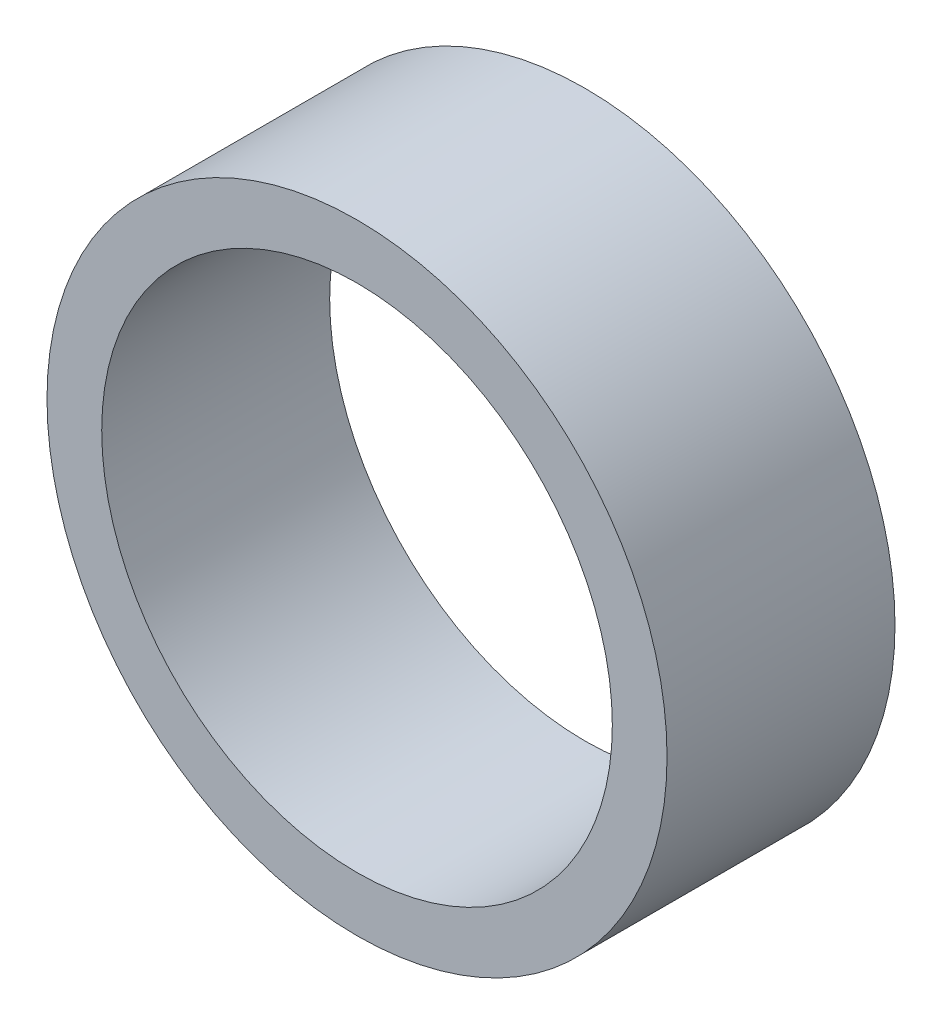
ISO-10303-21;
HEADER;
FILE_DESCRIPTION(('STEP AP214'),'2;1');
FILE_NAME('part.step','',(''),(''),'','','');
FILE_SCHEMA(('AUTOMOTIVE_DESIGN { 1 0 10303 214 1 1 1 1 }'));
ENDSEC;
DATA;
#1=APPLICATION_CONTEXT('core data for automotive mechanical design processes');
#2=APPLICATION_PROTOCOL_DEFINITION('international standard','automotive_design',2000,#1);
#3=PRODUCT_CONTEXT('',#1,'mechanical');
#4=PRODUCT('Part','Part','',(#3));
#5=PRODUCT_RELATED_PRODUCT_CATEGORY('part','',(#4));
#6=PRODUCT_DEFINITION_FORMATION('','',#4);
#7=PRODUCT_DEFINITION_CONTEXT('part definition',#1,'design');
#8=PRODUCT_DEFINITION('design','',#6,#7);
#9=PRODUCT_DEFINITION_SHAPE('','',#8);
#10=(LENGTH_UNIT() NAMED_UNIT(*) SI_UNIT(.MILLI.,.METRE.));
#11=(NAMED_UNIT(*) PLANE_ANGLE_UNIT() SI_UNIT($,.RADIAN.));
#12=(NAMED_UNIT(*) SI_UNIT($,.STERADIAN.) SOLID_ANGLE_UNIT());
#13=UNCERTAINTY_MEASURE_WITH_UNIT(LENGTH_MEASURE(1.E-05),#10,'distance_accuracy_value','');
#14=(GEOMETRIC_REPRESENTATION_CONTEXT(3) GLOBAL_UNCERTAINTY_ASSIGNED_CONTEXT((#13)) GLOBAL_UNIT_ASSIGNED_CONTEXT((#10,
#11,#12)) REPRESENTATION_CONTEXT('',''));
#15=CARTESIAN_POINT('',(0.,0.,0.));
#16=DIRECTION('',(0.,0.,1.));
#17=DIRECTION('',(1.,0.,0.));
#18=AXIS2_PLACEMENT_3D('',#15,#16,#17);
#19=CARTESIAN_POINT('',(0.,0.,10.));
#20=DIRECTION('',(0.,0.,1.));
#21=DIRECTION('',(1.,0.,0.));
#22=AXIS2_PLACEMENT_3D('',#19,#20,#21);
#23=PLANE('',#22);
#24=CARTESIAN_POINT('',(0.,0.,10.));
#25=DIRECTION('',(0.,0.,1.));
#26=DIRECTION('',(1.,0.,0.));
#27=AXIS2_PLACEMENT_3D('',#24,#25,#26);
#28=CIRCLE('',#27,13.6);
#29=CARTESIAN_POINT('',(13.6,0.,10.));
#30=VERTEX_POINT('',#29);
#31=EDGE_CURVE('E10',#30,#30,#28,.T.);
#32=ORIENTED_EDGE('',*,*,#31,.T.);
#33=EDGE_LOOP('',(#32));
#34=FACE_BOUND('',#33,.T.);
#35=CARTESIAN_POINT('',(0.,0.,10.));
#36=DIRECTION('',(0.,0.,1.));
#37=DIRECTION('',(1.,0.,0.));
#38=AXIS2_PLACEMENT_3D('',#35,#36,#37);
#39=CIRCLE('',#38,11.2);
#40=CARTESIAN_POINT('',(11.2,0.,10.));
#41=VERTEX_POINT('',#40);
#42=EDGE_CURVE('E42',#41,#41,#39,.T.);
#43=ORIENTED_EDGE('',*,*,#42,.F.);
#44=EDGE_LOOP('',(#43));
#45=FACE_BOUND('',#44,.T.);
#46=ADVANCED_FACE('F31',(#34,#45),#23,.T.);
#47=CARTESIAN_POINT('',(0.,0.,0.));
#48=DIRECTION('',(0.,0.,1.));
#49=DIRECTION('',(1.,0.,0.));
#50=AXIS2_PLACEMENT_3D('',#47,#48,#49);
#51=PLANE('',#50);
#52=CARTESIAN_POINT('',(0.,0.,0.));
#53=DIRECTION('',(0.,0.,1.));
#54=DIRECTION('',(1.,0.,0.));
#55=AXIS2_PLACEMENT_3D('',#52,#53,#54);
#56=CIRCLE('',#55,13.6);
#57=CARTESIAN_POINT('',(13.6,0.,0.));
#58=VERTEX_POINT('',#57);
#59=EDGE_CURVE('E35',#58,#58,#56,.T.);
#60=ORIENTED_EDGE('',*,*,#59,.F.);
#61=EDGE_LOOP('',(#60));
#62=FACE_BOUND('',#61,.T.);
#63=CARTESIAN_POINT('',(0.,0.,0.));
#64=DIRECTION('',(0.,0.,1.));
#65=DIRECTION('',(1.,0.,0.));
#66=AXIS2_PLACEMENT_3D('',#63,#64,#65);
#67=CIRCLE('',#66,11.2);
#68=CARTESIAN_POINT('',(11.2,0.,0.));
#69=VERTEX_POINT('',#68);
#70=EDGE_CURVE('E44',#69,#69,#67,.T.);
#71=ORIENTED_EDGE('',*,*,#70,.T.);
#72=EDGE_LOOP('',(#71));
#73=FACE_BOUND('',#72,.T.);
#74=ADVANCED_FACE('F54',(#62,#73),#51,.F.);
#75=CARTESIAN_POINT('',(0.,0.,10.));
#76=DIRECTION('',(0.,0.,-1.));
#77=DIRECTION('',(-1.,0.,0.));
#78=AXIS2_PLACEMENT_3D('',#75,#76,#77);
#79=CYLINDRICAL_SURFACE('',#78,13.6);
#80=ORIENTED_EDGE('',*,*,#31,.F.);
#81=EDGE_LOOP('',(#80));
#82=FACE_BOUND('',#81,.T.);
#83=ORIENTED_EDGE('',*,*,#59,.T.);
#84=EDGE_LOOP('',(#83));
#85=FACE_BOUND('',#84,.T.);
#86=ADVANCED_FACE('F33',(#82,#85),#79,.T.);
#87=CARTESIAN_POINT('',(0.,0.,10.));
#88=DIRECTION('',(0.,0.,-1.));
#89=DIRECTION('',(-1.,0.,0.));
#90=AXIS2_PLACEMENT_3D('',#87,#88,#89);
#91=CYLINDRICAL_SURFACE('',#90,11.2);
#92=ORIENTED_EDGE('',*,*,#42,.T.);
#93=EDGE_LOOP('',(#92));
#94=FACE_BOUND('',#93,.T.);
#95=ORIENTED_EDGE('',*,*,#70,.F.);
#96=EDGE_LOOP('',(#95));
#97=FACE_BOUND('',#96,.T.);
#98=ADVANCED_FACE('F50',(#94,#97),#91,.F.);
#99=CLOSED_SHELL('',(#46,#74,#86,#98));
#100=MANIFOLD_SOLID_BREP('B2',#99);
#101=ADVANCED_BREP_SHAPE_REPRESENTATION('',(#18,#100),#14);
#102=SHAPE_DEFINITION_REPRESENTATION(#9,#101);
ENDSEC;
END-ISO-10303-21;
